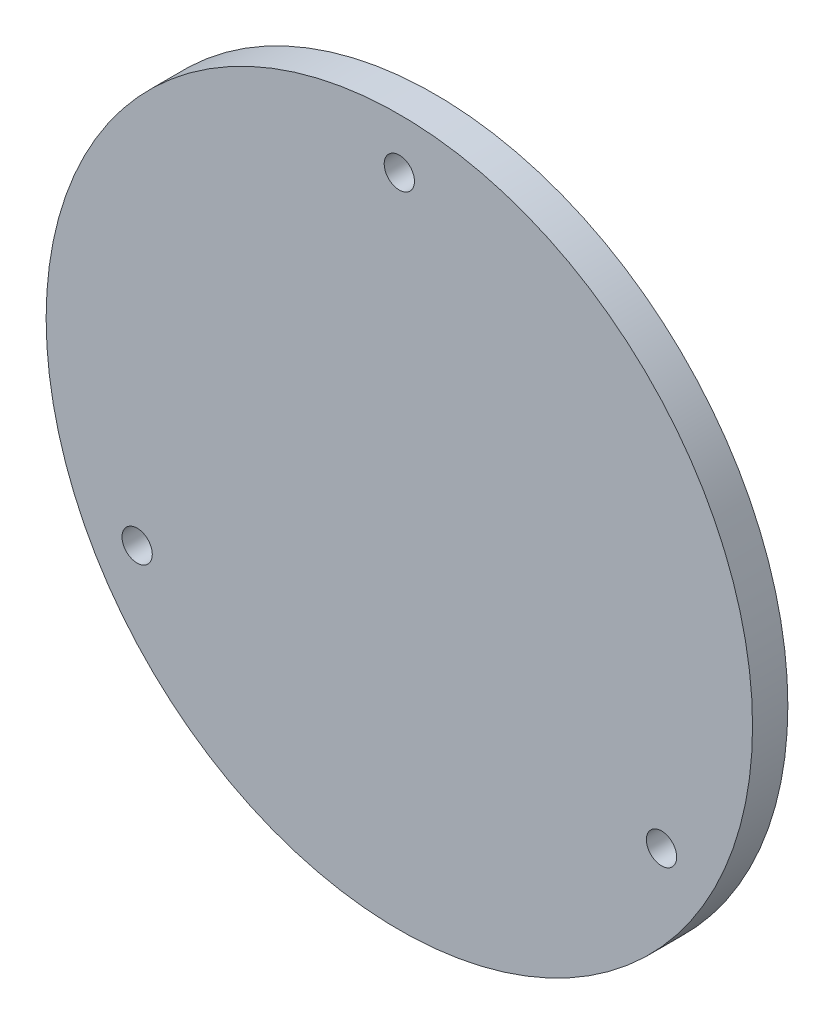
ISO-10303-21;
HEADER;
FILE_DESCRIPTION(('STEP AP214'),'2;1');
FILE_NAME('part.step','',(''),(''),'','','');
FILE_SCHEMA(('AUTOMOTIVE_DESIGN { 1 0 10303 214 1 1 1 1 }'));
ENDSEC;
DATA;
#1=APPLICATION_CONTEXT('core data for automotive mechanical design processes');
#2=APPLICATION_PROTOCOL_DEFINITION('international standard','automotive_design',2000,#1);
#3=PRODUCT_CONTEXT('',#1,'mechanical');
#4=PRODUCT('Part','Part','',(#3));
#5=PRODUCT_RELATED_PRODUCT_CATEGORY('part','',(#4));
#6=PRODUCT_DEFINITION_FORMATION('','',#4);
#7=PRODUCT_DEFINITION_CONTEXT('part definition',#1,'design');
#8=PRODUCT_DEFINITION('design','',#6,#7);
#9=PRODUCT_DEFINITION_SHAPE('','',#8);
#10=(LENGTH_UNIT() NAMED_UNIT(*) SI_UNIT(.MILLI.,.METRE.));
#11=(NAMED_UNIT(*) PLANE_ANGLE_UNIT() SI_UNIT($,.RADIAN.));
#12=(NAMED_UNIT(*) SI_UNIT($,.STERADIAN.) SOLID_ANGLE_UNIT());
#13=UNCERTAINTY_MEASURE_WITH_UNIT(LENGTH_MEASURE(1.E-05),#10,'distance_accuracy_value','');
#14=(GEOMETRIC_REPRESENTATION_CONTEXT(3) GLOBAL_UNCERTAINTY_ASSIGNED_CONTEXT((#13)) GLOBAL_UNIT_ASSIGNED_CONTEXT((#10,
#11,#12)) REPRESENTATION_CONTEXT('',''));
#15=CARTESIAN_POINT('',(0.,0.,0.));
#16=DIRECTION('',(0.,0.,1.));
#17=DIRECTION('',(1.,0.,0.));
#18=AXIS2_PLACEMENT_3D('',#15,#16,#17);
#19=CARTESIAN_POINT('',(0.,0.,7.));
#20=DIRECTION('',(0.,0.,-1.));
#21=DIRECTION('',(-1.,0.,0.));
#22=AXIS2_PLACEMENT_3D('',#19,#20,#21);
#23=CYLINDRICAL_SURFACE('',#22,70.);
#24=CARTESIAN_POINT('',(0.,0.,7.));
#25=DIRECTION('',(0.,0.,1.));
#26=DIRECTION('',(1.,0.,0.));
#27=AXIS2_PLACEMENT_3D('',#24,#25,#26);
#28=CIRCLE('',#27,70.);
#29=CARTESIAN_POINT('',(70.,0.,7.));
#30=VERTEX_POINT('',#29);
#31=EDGE_CURVE('E50',#30,#30,#28,.T.);
#32=ORIENTED_EDGE('',*,*,#31,.F.);
#33=EDGE_LOOP('',(#32));
#34=FACE_BOUND('',#33,.T.);
#35=CARTESIAN_POINT('',(0.,0.,0.));
#36=DIRECTION('',(0.,0.,1.));
#37=DIRECTION('',(1.,0.,0.));
#38=AXIS2_PLACEMENT_3D('',#35,#36,#37);
#39=CIRCLE('',#38,70.);
#40=CARTESIAN_POINT('',(70.,0.,0.));
#41=VERTEX_POINT('',#40);
#42=EDGE_CURVE('E55',#41,#41,#39,.T.);
#43=ORIENTED_EDGE('',*,*,#42,.T.);
#44=EDGE_LOOP('',(#43));
#45=FACE_BOUND('',#44,.T.);
#46=ADVANCED_FACE('F43',(#34,#45),#23,.T.);
#47=CARTESIAN_POINT('',(0.,0.,7.));
#48=DIRECTION('',(0.,0.,1.));
#49=DIRECTION('',(1.,0.,0.));
#50=AXIS2_PLACEMENT_3D('',#47,#48,#49);
#51=PLANE('',#50);
#52=CARTESIAN_POINT('',(0.,60.,7.));
#53=DIRECTION('',(0.,0.,1.));
#54=DIRECTION('',(1.,0.,0.));
#55=AXIS2_PLACEMENT_3D('',#52,#53,#54);
#56=CIRCLE('',#55,3.);
#57=CARTESIAN_POINT('',(3.,60.,7.));
#58=VERTEX_POINT('',#57);
#59=EDGE_CURVE('E62',#58,#58,#56,.T.);
#60=ORIENTED_EDGE('',*,*,#59,.F.);
#61=EDGE_LOOP('',(#60));
#62=FACE_BOUND('',#61,.T.);
#63=CARTESIAN_POINT('',(51.9615242270702,-29.9999999999978,7.));
#64=DIRECTION('',(0.,0.,1.));
#65=DIRECTION('',(1.,0.,0.));
#66=AXIS2_PLACEMENT_3D('',#63,#64,#65);
#67=CIRCLE('',#66,3.00000000000333);
#68=CARTESIAN_POINT('',(54.9615242270735,-29.9999999999978,7.));
#69=VERTEX_POINT('',#68);
#70=EDGE_CURVE('E189',#69,#69,#67,.T.);
#71=ORIENTED_EDGE('',*,*,#70,.F.);
#72=EDGE_LOOP('',(#71));
#73=FACE_BOUND('',#72,.T.);
#74=CARTESIAN_POINT('',(-51.9615242270625,-30.0000000000022,7.));
#75=DIRECTION('',(0.,0.,1.));
#76=DIRECTION('',(1.,0.,0.));
#77=AXIS2_PLACEMENT_3D('',#74,#75,#76);
#78=CIRCLE('',#77,3.00000000000486);
#79=CARTESIAN_POINT('',(-48.9615242270576,-30.0000000000022,7.));
#80=VERTEX_POINT('',#79);
#81=EDGE_CURVE('E192',#80,#80,#78,.T.);
#82=ORIENTED_EDGE('',*,*,#81,.F.);
#83=EDGE_LOOP('',(#82));
#84=FACE_BOUND('',#83,.T.);
#85=ORIENTED_EDGE('',*,*,#31,.T.);
#86=EDGE_LOOP('',(#85));
#87=FACE_BOUND('',#86,.T.);
#88=ADVANCED_FACE('F90',(#62,#73,#84,#87),#51,.T.);
#89=CARTESIAN_POINT('',(0.,0.,0.));
#90=DIRECTION('',(0.,0.,1.));
#91=DIRECTION('',(1.,0.,0.));
#92=AXIS2_PLACEMENT_3D('',#89,#90,#91);
#93=PLANE('',#92);
#94=CARTESIAN_POINT('',(0.,60.,0.));
#95=DIRECTION('',(0.,0.,1.));
#96=DIRECTION('',(1.,0.,0.));
#97=AXIS2_PLACEMENT_3D('',#94,#95,#96);
#98=CIRCLE('',#97,3.);
#99=CARTESIAN_POINT('',(3.,60.,0.));
#100=VERTEX_POINT('',#99);
#101=EDGE_CURVE('E46',#100,#100,#98,.T.);
#102=ORIENTED_EDGE('',*,*,#101,.T.);
#103=EDGE_LOOP('',(#102));
#104=FACE_BOUND('',#103,.T.);
#105=CARTESIAN_POINT('',(51.9615242270702,-29.9999999999978,0.));
#106=DIRECTION('',(0.,0.,1.));
#107=DIRECTION('',(1.,0.,0.));
#108=AXIS2_PLACEMENT_3D('',#105,#106,#107);
#109=CIRCLE('',#108,3.00000000000333);
#110=CARTESIAN_POINT('',(54.9615242270735,-29.9999999999978,0.));
#111=VERTEX_POINT('',#110);
#112=EDGE_CURVE('E61',#111,#111,#109,.T.);
#113=ORIENTED_EDGE('',*,*,#112,.T.);
#114=EDGE_LOOP('',(#113));
#115=FACE_BOUND('',#114,.T.);
#116=CARTESIAN_POINT('',(-51.9615242270625,-30.0000000000022,0.));
#117=DIRECTION('',(0.,0.,1.));
#118=DIRECTION('',(1.,0.,0.));
#119=AXIS2_PLACEMENT_3D('',#116,#117,#118);
#120=CIRCLE('',#119,3.00000000000486);
#121=CARTESIAN_POINT('',(-48.9615242270576,-30.0000000000022,0.));
#122=VERTEX_POINT('',#121);
#123=EDGE_CURVE('E59',#122,#122,#120,.T.);
#124=ORIENTED_EDGE('',*,*,#123,.T.);
#125=EDGE_LOOP('',(#124));
#126=FACE_BOUND('',#125,.T.);
#127=CARTESIAN_POINT('',(0.,0.,0.));
#128=DIRECTION('',(0.,0.,1.));
#129=DIRECTION('',(1.,0.,0.));
#130=AXIS2_PLACEMENT_3D('',#127,#128,#129);
#131=CIRCLE('',#130,55.);
#132=CARTESIAN_POINT('',(55.,0.,0.));
#133=VERTEX_POINT('',#132);
#134=EDGE_CURVE('E11',#133,#133,#131,.F.);
#135=ORIENTED_EDGE('',*,*,#134,.F.);
#136=EDGE_LOOP('',(#135));
#137=FACE_BOUND('',#136,.T.);
#138=ORIENTED_EDGE('',*,*,#42,.F.);
#139=EDGE_LOOP('',(#138));
#140=FACE_BOUND('',#139,.T.);
#141=ADVANCED_FACE('F87',(#104,#115,#126,#137,#140),#93,.F.);
#142=CARTESIAN_POINT('',(0.,0.,-3.));
#143=DIRECTION('',(0.,0.,-1.));
#144=DIRECTION('',(-1.,0.,0.));
#145=AXIS2_PLACEMENT_3D('',#142,#143,#144);
#146=PLANE('',#145);
#147=CARTESIAN_POINT('',(0.,0.,-3.));
#148=DIRECTION('',(0.,0.,-1.));
#149=DIRECTION('',(-1.,0.,0.));
#150=AXIS2_PLACEMENT_3D('',#147,#148,#149);
#151=CIRCLE('',#150,55.);
#152=CARTESIAN_POINT('',(-55.,0.,-3.));
#153=VERTEX_POINT('',#152);
#154=EDGE_CURVE('E76',#153,#153,#151,.T.);
#155=ORIENTED_EDGE('',*,*,#154,.T.);
#156=EDGE_LOOP('',(#155));
#157=FACE_BOUND('',#156,.T.);
#158=CARTESIAN_POINT('',(0.,0.,-3.));
#159=DIRECTION('',(0.,0.,-1.));
#160=DIRECTION('',(-1.,0.,0.));
#161=AXIS2_PLACEMENT_3D('',#158,#159,#160);
#162=CIRCLE('',#161,50.);
#163=CARTESIAN_POINT('',(-50.,0.,-3.));
#164=VERTEX_POINT('',#163);
#165=EDGE_CURVE('E71',#164,#164,#162,.T.);
#166=ORIENTED_EDGE('',*,*,#165,.F.);
#167=EDGE_LOOP('',(#166));
#168=FACE_BOUND('',#167,.T.);
#169=ADVANCED_FACE('F89',(#157,#168),#146,.T.);
#170=CARTESIAN_POINT('',(0.,0.,-3.));
#171=DIRECTION('',(0.,0.,1.));
#172=DIRECTION('',(1.,0.,0.));
#173=AXIS2_PLACEMENT_3D('',#170,#171,#172);
#174=CYLINDRICAL_SURFACE('',#173,55.);
#175=ORIENTED_EDGE('',*,*,#154,.F.);
#176=EDGE_LOOP('',(#175));
#177=FACE_BOUND('',#176,.T.);
#178=ORIENTED_EDGE('',*,*,#134,.T.);
#179=EDGE_LOOP('',(#178));
#180=FACE_BOUND('',#179,.T.);
#181=ADVANCED_FACE('F96',(#177,#180),#174,.T.);
#182=CARTESIAN_POINT('',(0.,0.,-3.));
#183=DIRECTION('',(0.,0.,1.));
#184=DIRECTION('',(1.,0.,0.));
#185=AXIS2_PLACEMENT_3D('',#182,#183,#184);
#186=CYLINDRICAL_SURFACE('',#185,50.);
#187=ORIENTED_EDGE('',*,*,#165,.T.);
#188=EDGE_LOOP('',(#187));
#189=FACE_BOUND('',#188,.T.);
#190=CARTESIAN_POINT('',(0.,0.,0.));
#191=DIRECTION('',(0.,0.,-1.));
#192=DIRECTION('',(-1.,0.,0.));
#193=AXIS2_PLACEMENT_3D('',#190,#191,#192);
#194=CIRCLE('',#193,50.);
#195=CARTESIAN_POINT('',(-50.,0.,0.));
#196=VERTEX_POINT('',#195);
#197=EDGE_CURVE('E67',#196,#196,#194,.T.);
#198=ORIENTED_EDGE('',*,*,#197,.F.);
#199=EDGE_LOOP('',(#198));
#200=FACE_BOUND('',#199,.T.);
#201=ADVANCED_FACE('F102',(#189,#200),#186,.F.);
#202=ORIENTED_EDGE('',*,*,#197,.T.);
#203=EDGE_LOOP('',(#202));
#204=FACE_BOUND('',#203,.T.);
#205=ADVANCED_FACE('F91',(#204),#93,.F.);
#206=CARTESIAN_POINT('',(-51.9615242270625,-30.0000000000022,-3.));
#207=DIRECTION('',(0.,0.,1.));
#208=DIRECTION('',(1.,0.,0.));
#209=AXIS2_PLACEMENT_3D('',#206,#207,#208);
#210=CYLINDRICAL_SURFACE('',#209,3.00000000000486);
#211=ORIENTED_EDGE('',*,*,#81,.T.);
#212=EDGE_LOOP('',(#211));
#213=FACE_BOUND('',#212,.T.);
#214=ORIENTED_EDGE('',*,*,#123,.F.);
#215=EDGE_LOOP('',(#214));
#216=FACE_BOUND('',#215,.T.);
#217=ADVANCED_FACE('F101',(#213,#216),#210,.F.);
#218=CARTESIAN_POINT('',(51.9615242270702,-29.9999999999978,-3.));
#219=DIRECTION('',(0.,0.,1.));
#220=DIRECTION('',(1.,0.,0.));
#221=AXIS2_PLACEMENT_3D('',#218,#219,#220);
#222=CYLINDRICAL_SURFACE('',#221,3.00000000000333);
#223=ORIENTED_EDGE('',*,*,#70,.T.);
#224=EDGE_LOOP('',(#223));
#225=FACE_BOUND('',#224,.T.);
#226=ORIENTED_EDGE('',*,*,#112,.F.);
#227=EDGE_LOOP('',(#226));
#228=FACE_BOUND('',#227,.T.);
#229=ADVANCED_FACE('F131',(#225,#228),#222,.F.);
#230=CARTESIAN_POINT('',(0.,60.,-3.));
#231=DIRECTION('',(0.,0.,1.));
#232=DIRECTION('',(1.,0.,0.));
#233=AXIS2_PLACEMENT_3D('',#230,#231,#232);
#234=CYLINDRICAL_SURFACE('',#233,3.);
#235=ORIENTED_EDGE('',*,*,#59,.T.);
#236=EDGE_LOOP('',(#235));
#237=FACE_BOUND('',#236,.T.);
#238=ORIENTED_EDGE('',*,*,#101,.F.);
#239=EDGE_LOOP('',(#238));
#240=FACE_BOUND('',#239,.T.);
#241=ADVANCED_FACE('F142',(#237,#240),#234,.F.);
#242=CLOSED_SHELL('',(#46,#88,#141,#169,#181,#201,#205,#217,#229,#241));
#243=MANIFOLD_SOLID_BREP('B2',#242);
#244=ADVANCED_BREP_SHAPE_REPRESENTATION('',(#18,#243),#14);
#245=SHAPE_DEFINITION_REPRESENTATION(#9,#244);
ENDSEC;
END-ISO-10303-21;
